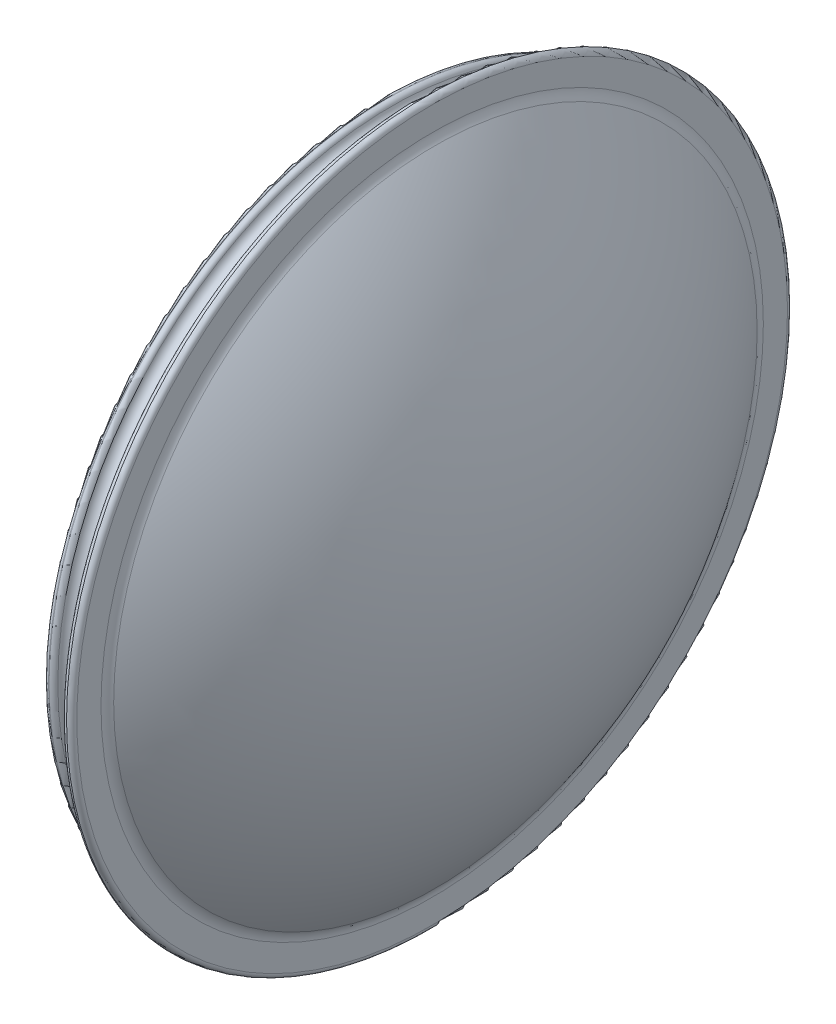
ISO-10303-21;
HEADER;
FILE_DESCRIPTION(('STEP AP214'),'2;1');
FILE_NAME('part.step','',(''),(''),'','','');
FILE_SCHEMA(('AUTOMOTIVE_DESIGN { 1 0 10303 214 1 1 1 1 }'));
ENDSEC;
DATA;
#1=APPLICATION_CONTEXT('core data for automotive mechanical design processes');
#2=APPLICATION_PROTOCOL_DEFINITION('international standard','automotive_design',2000,#1);
#3=PRODUCT_CONTEXT('',#1,'mechanical');
#4=PRODUCT('Part','Part','',(#3));
#5=PRODUCT_RELATED_PRODUCT_CATEGORY('part','',(#4));
#6=PRODUCT_DEFINITION_FORMATION('','',#4);
#7=PRODUCT_DEFINITION_CONTEXT('part definition',#1,'design');
#8=PRODUCT_DEFINITION('design','',#6,#7);
#9=PRODUCT_DEFINITION_SHAPE('','',#8);
#10=(LENGTH_UNIT() NAMED_UNIT(*) SI_UNIT(.MILLI.,.METRE.));
#11=(NAMED_UNIT(*) PLANE_ANGLE_UNIT() SI_UNIT($,.RADIAN.));
#12=(NAMED_UNIT(*) SI_UNIT($,.STERADIAN.) SOLID_ANGLE_UNIT());
#13=UNCERTAINTY_MEASURE_WITH_UNIT(LENGTH_MEASURE(1.E-05),#10,'distance_accuracy_value','');
#14=(GEOMETRIC_REPRESENTATION_CONTEXT(3) GLOBAL_UNCERTAINTY_ASSIGNED_CONTEXT((#13)) GLOBAL_UNIT_ASSIGNED_CONTEXT((#10,
#11,#12)) REPRESENTATION_CONTEXT('',''));
#15=CARTESIAN_POINT('',(0.,0.,0.));
#16=DIRECTION('',(0.,0.,1.));
#17=DIRECTION('',(1.,0.,0.));
#18=AXIS2_PLACEMENT_3D('',#15,#16,#17);
#19=CARTESIAN_POINT('',(350.,0.,0.));
#20=DIRECTION('',(1.,0.,0.));
#21=DIRECTION('',(0.,0.,-1.));
#22=AXIS2_PLACEMENT_3D('',#19,#20,#21);
#23=CYLINDRICAL_SURFACE('',#22,316.385840391127);
#24=CARTESIAN_POINT('',(370.,0.,0.));
#25=DIRECTION('',(-1.,0.,0.));
#26=DIRECTION('',(0.,0.,1.));
#27=AXIS2_PLACEMENT_3D('',#24,#25,#26);
#28=CIRCLE('',#27,316.385840391127);
#29=CARTESIAN_POINT('',(370.,0.,316.385840391127));
#30=VERTEX_POINT('',#29);
#31=EDGE_CURVE('E87',#30,#30,#28,.F.);
#32=ORIENTED_EDGE('',*,*,#31,.T.);
#33=EDGE_LOOP('',(#32));
#34=FACE_BOUND('',#33,.T.);
#35=CARTESIAN_POINT('',(380.,0.,0.));
#36=DIRECTION('',(1.,0.,0.));
#37=DIRECTION('',(0.,0.,-1.));
#38=AXIS2_PLACEMENT_3D('',#35,#36,#37);
#39=CIRCLE('',#38,316.385840391127);
#40=CARTESIAN_POINT('',(380.,0.,-316.385840391127));
#41=VERTEX_POINT('',#40);
#42=EDGE_CURVE('E91',#41,#41,#39,.F.);
#43=ORIENTED_EDGE('',*,*,#42,.T.);
#44=EDGE_LOOP('',(#43));
#45=FACE_BOUND('',#44,.T.);
#46=ADVANCED_FACE('F38',(#34,#45),#23,.T.);
#47=CARTESIAN_POINT('',(390.,0.,0.));
#48=DIRECTION('',(1.,0.,0.));
#49=DIRECTION('',(0.,0.,-1.));
#50=AXIS2_PLACEMENT_3D('',#47,#48,#49);
#51=PLANE('',#50);
#52=CARTESIAN_POINT('',(390.,0.,0.));
#53=DIRECTION('',(1.,0.,0.));
#54=DIRECTION('',(0.,0.,-1.));
#55=AXIS2_PLACEMENT_3D('',#52,#53,#54);
#56=CIRCLE('',#55,345.);
#57=CARTESIAN_POINT('',(390.,0.,-345.));
#58=VERTEX_POINT('',#57);
#59=EDGE_CURVE('E67',#58,#58,#56,.F.);
#60=ORIENTED_EDGE('',*,*,#59,.T.);
#61=EDGE_LOOP('',(#60));
#62=FACE_BOUND('',#61,.T.);
#63=CARTESIAN_POINT('',(390.,0.,0.));
#64=DIRECTION('',(1.,0.,0.));
#65=DIRECTION('',(0.,0.,-1.));
#66=AXIS2_PLACEMENT_3D('',#63,#64,#65);
#67=CIRCLE('',#66,326.385840391127);
#68=CARTESIAN_POINT('',(390.,0.,-326.385840391127));
#69=VERTEX_POINT('',#68);
#70=EDGE_CURVE('E83',#69,#69,#67,.T.);
#71=ORIENTED_EDGE('',*,*,#70,.T.);
#72=EDGE_LOOP('',(#71));
#73=FACE_BOUND('',#72,.T.);
#74=ADVANCED_FACE('F134',(#62,#73),#51,.F.);
#75=CARTESIAN_POINT('',(400.,0.,0.));
#76=DIRECTION('',(1.,0.,0.));
#77=DIRECTION('',(0.,0.,-1.));
#78=AXIS2_PLACEMENT_3D('',#75,#76,#77);
#79=PLANE('',#78);
#80=CARTESIAN_POINT('',(400.,0.,0.));
#81=DIRECTION('',(1.,0.,0.));
#82=DIRECTION('',(0.,0.,-1.));
#83=AXIS2_PLACEMENT_3D('',#80,#81,#82);
#84=CIRCLE('',#83,321.558703816271);
#85=CARTESIAN_POINT('',(400.,0.,-321.558703816271));
#86=VERTEX_POINT('',#85);
#87=EDGE_CURVE('E46',#86,#86,#84,.F.);
#88=ORIENTED_EDGE('',*,*,#87,.T.);
#89=EDGE_LOOP('',(#88));
#90=FACE_BOUND('',#89,.T.);
#91=CARTESIAN_POINT('',(400.,0.,0.));
#92=DIRECTION('',(1.,0.,0.));
#93=DIRECTION('',(0.,0.,-1.));
#94=AXIS2_PLACEMENT_3D('',#91,#92,#93);
#95=CIRCLE('',#94,345.);
#96=CARTESIAN_POINT('',(400.,0.,-345.));
#97=VERTEX_POINT('',#96);
#98=EDGE_CURVE('E51',#97,#97,#95,.T.);
#99=ORIENTED_EDGE('',*,*,#98,.T.);
#100=EDGE_LOOP('',(#99));
#101=FACE_BOUND('',#100,.T.);
#102=ADVANCED_FACE('F141',(#90,#101),#79,.T.);
#103=CARTESIAN_POINT('',(0.,0.,0.));
#104=DIRECTION('',(0.,1.,0.));
#105=DIRECTION('',(1.,0.,0.));
#106=AXIS2_PLACEMENT_3D('',#103,#104,#105);
#107=SPHERICAL_SURFACE('',#106,510.);
#108=CARTESIAN_POINT('',(0.,0.,0.));
#109=DIRECTION('',(-1.,0.,0.));
#110=DIRECTION('',(0.,0.,1.));
#111=AXIS2_PLACEMENT_3D('',#108,#109,#110);
#112=SPHERICAL_SURFACE('',#111,510.);
#113=CARTESIAN_POINT('',(403.142857142857,0.,0.));
#114=DIRECTION('',(-1.,0.,0.));
#115=DIRECTION('',(0.,0.,1.));
#116=AXIS2_PLACEMENT_3D('',#113,#114,#115);
#117=CIRCLE('',#116,312.371312278663);
#118=CARTESIAN_POINT('',(403.142857142857,0.,312.371312278663));
#119=VERTEX_POINT('',#118);
#120=EDGE_CURVE('E10',#119,#119,#117,.F.);
#121=ORIENTED_EDGE('',*,*,#120,.T.);
#122=EDGE_LOOP('',(#121));
#123=FACE_BOUND('',#122,.T.);
#124=ADVANCED_FACE('F148',(#123),#112,.T.);
#125=CARTESIAN_POINT('',(360.,0.,0.));
#126=DIRECTION('',(-1.,0.,0.));
#127=DIRECTION('',(0.,0.,1.));
#128=AXIS2_PLACEMENT_3D('',#125,#126,#127);
#129=CYLINDRICAL_SURFACE('',#128,327.5);
#130=CARTESIAN_POINT('',(355.,0.,0.));
#131=DIRECTION('',(-1.,0.,0.));
#132=DIRECTION('',(0.,0.,1.));
#133=AXIS2_PLACEMENT_3D('',#130,#131,#132);
#134=CIRCLE('',#133,327.5);
#135=CARTESIAN_POINT('',(355.,0.,327.5));
#136=VERTEX_POINT('',#135);
#137=EDGE_CURVE('E71',#136,#136,#134,.F.);
#138=ORIENTED_EDGE('',*,*,#137,.T.);
#139=EDGE_LOOP('',(#138));
#140=FACE_BOUND('',#139,.T.);
#141=CARTESIAN_POINT('',(355.512065555964,0.,0.));
#142=DIRECTION('',(1.,0.,0.));
#143=DIRECTION('',(0.,0.,-1.));
#144=AXIS2_PLACEMENT_3D('',#141,#142,#143);
#145=CIRCLE('',#144,327.5);
#146=CARTESIAN_POINT('',(355.512065555964,0.,-327.5));
#147=VERTEX_POINT('',#146);
#148=EDGE_CURVE('E75',#147,#147,#145,.F.);
#149=ORIENTED_EDGE('',*,*,#148,.T.);
#150=EDGE_LOOP('',(#149));
#151=FACE_BOUND('',#150,.T.);
#152=ADVANCED_FACE('F127',(#140,#151),#129,.T.);
#153=CARTESIAN_POINT('',(0.,0.,0.));
#154=DIRECTION('',(0.,1.,0.));
#155=DIRECTION('',(1.,0.,0.));
#156=AXIS2_PLACEMENT_3D('',#153,#154,#155);
#157=SPHERICAL_SURFACE('',#156,500.);
#158=CARTESIAN_POINT('',(0.,0.,0.));
#159=DIRECTION('',(-1.,0.,0.));
#160=DIRECTION('',(0.,0.,1.));
#161=AXIS2_PLACEMENT_3D('',#158,#159,#160);
#162=SPHERICAL_SURFACE('',#161,500.);
#163=CARTESIAN_POINT('',(403.028931798602,0.,0.));
#164=DIRECTION('',(-1.,0.,0.));
#165=DIRECTION('',(0.,0.,1.));
#166=AXIS2_PLACEMENT_3D('',#163,#164,#165);
#167=CIRCLE('',#166,295.918367346939);
#168=CARTESIAN_POINT('',(403.028931798602,0.,295.918367346939));
#169=VERTEX_POINT('',#168);
#170=EDGE_CURVE('E95',#169,#169,#167,.T.);
#171=ORIENTED_EDGE('',*,*,#170,.T.);
#172=EDGE_LOOP('',(#171));
#173=FACE_BOUND('',#172,.T.);
#174=ADVANCED_FACE('F115',(#173),#162,.F.);
#175=CARTESIAN_POINT('',(394.96835316263,0.,0.));
#176=DIRECTION('',(-1.,0.,0.));
#177=DIRECTION('',(0.,0.,1.));
#178=AXIS2_PLACEMENT_3D('',#175,#176,#177);
#179=TOROIDAL_SURFACE('',#178,290.,10.);
#180=ORIENTED_EDGE('',*,*,#170,.F.);
#181=EDGE_LOOP('',(#180));
#182=FACE_BOUND('',#181,.T.);
#183=CARTESIAN_POINT('',(394.96835316263,0.,0.));
#184=DIRECTION('',(-1.,0.,0.));
#185=DIRECTION('',(0.,0.,1.));
#186=AXIS2_PLACEMENT_3D('',#183,#184,#185);
#187=CIRCLE('',#186,300.);
#188=CARTESIAN_POINT('',(394.96835316263,0.,300.));
#189=VERTEX_POINT('',#188);
#190=EDGE_CURVE('E62',#189,#189,#187,.F.);
#191=ORIENTED_EDGE('',*,*,#190,.F.);
#192=EDGE_LOOP('',(#191));
#193=FACE_BOUND('',#192,.T.);
#194=ADVANCED_FACE('F113',(#182,#193),#179,.F.);
#195=CARTESIAN_POINT('',(350.,0.,0.));
#196=DIRECTION('',(1.,0.,0.));
#197=DIRECTION('',(0.,0.,-1.));
#198=AXIS2_PLACEMENT_3D('',#195,#196,#197);
#199=CYLINDRICAL_SURFACE('',#198,300.);
#200=CARTESIAN_POINT('',(360.,0.,0.));
#201=DIRECTION('',(-1.,0.,0.));
#202=DIRECTION('',(0.,0.,1.));
#203=AXIS2_PLACEMENT_3D('',#200,#201,#202);
#204=CIRCLE('',#203,300.);
#205=CARTESIAN_POINT('',(360.,0.,300.));
#206=VERTEX_POINT('',#205);
#207=EDGE_CURVE('E103',#206,#206,#204,.T.);
#208=ORIENTED_EDGE('',*,*,#207,.T.);
#209=EDGE_LOOP('',(#208));
#210=FACE_BOUND('',#209,.T.);
#211=ORIENTED_EDGE('',*,*,#190,.T.);
#212=EDGE_LOOP('',(#211));
#213=FACE_BOUND('',#212,.T.);
#214=ADVANCED_FACE('F111',(#210,#213),#199,.F.);
#215=CARTESIAN_POINT('',(360.,0.,0.));
#216=DIRECTION('',(-1.,0.,0.));
#217=DIRECTION('',(0.,0.,1.));
#218=AXIS2_PLACEMENT_3D('',#215,#216,#217);
#219=TOROIDAL_SURFACE('',#218,310.,10.);
#220=CARTESIAN_POINT('',(350.,0.,0.));
#221=DIRECTION('',(-1.,0.,0.));
#222=DIRECTION('',(0.,0.,1.));
#223=AXIS2_PLACEMENT_3D('',#220,#221,#222);
#224=CIRCLE('',#223,310.);
#225=CARTESIAN_POINT('',(350.,0.,310.));
#226=VERTEX_POINT('',#225);
#227=EDGE_CURVE('E99',#226,#226,#224,.F.);
#228=ORIENTED_EDGE('',*,*,#227,.F.);
#229=EDGE_LOOP('',(#228));
#230=FACE_BOUND('',#229,.T.);
#231=ORIENTED_EDGE('',*,*,#207,.F.);
#232=EDGE_LOOP('',(#231));
#233=FACE_BOUND('',#232,.T.);
#234=ADVANCED_FACE('F123',(#230,#233),#219,.T.);
#235=CARTESIAN_POINT('',(350.,0.,0.));
#236=DIRECTION('',(-1.,0.,0.));
#237=DIRECTION('',(0.,0.,1.));
#238=AXIS2_PLACEMENT_3D('',#235,#236,#237);
#239=PLANE('',#238);
#240=CARTESIAN_POINT('',(350.,0.,0.));
#241=DIRECTION('',(-1.,0.,0.));
#242=DIRECTION('',(0.,0.,1.));
#243=AXIS2_PLACEMENT_3D('',#240,#241,#242);
#244=CIRCLE('',#243,322.5);
#245=CARTESIAN_POINT('',(350.,0.,322.5));
#246=VERTEX_POINT('',#245);
#247=EDGE_CURVE('E79',#246,#246,#244,.T.);
#248=ORIENTED_EDGE('',*,*,#247,.T.);
#249=EDGE_LOOP('',(#248));
#250=FACE_BOUND('',#249,.T.);
#251=ORIENTED_EDGE('',*,*,#227,.T.);
#252=EDGE_LOOP('',(#251));
#253=FACE_BOUND('',#252,.T.);
#254=ADVANCED_FACE('F147',(#250,#253),#239,.T.);
#255=CARTESIAN_POINT('',(370.,0.,0.));
#256=DIRECTION('',(-1.,0.,0.));
#257=DIRECTION('',(0.,0.,1.));
#258=AXIS2_PLACEMENT_3D('',#255,#256,#257);
#259=TOROIDAL_SURFACE('',#258,326.385840391127,10.);
#260=CARTESIAN_POINT('',(360.341377037315,0.,0.));
#261=DIRECTION('',(1.,0.,0.));
#262=DIRECTION('',(0.,0.,-1.));
#263=AXIS2_PLACEMENT_3D('',#260,#261,#262);
#264=CIRCLE('',#263,323.795280130377);
#265=CARTESIAN_POINT('',(360.341377037315,0.,-323.795280130377));
#266=VERTEX_POINT('',#265);
#267=EDGE_CURVE('E56',#266,#266,#264,.T.);
#268=ORIENTED_EDGE('',*,*,#267,.T.);
#269=EDGE_LOOP('',(#268));
#270=FACE_BOUND('',#269,.T.);
#271=ORIENTED_EDGE('',*,*,#31,.F.);
#272=EDGE_LOOP('',(#271));
#273=FACE_BOUND('',#272,.T.);
#274=ADVANCED_FACE('F155',(#270,#273),#259,.F.);
#275=CARTESIAN_POINT('',(380.,0.,0.));
#276=DIRECTION('',(1.,0.,0.));
#277=DIRECTION('',(0.,0.,-1.));
#278=AXIS2_PLACEMENT_3D('',#275,#276,#277);
#279=TOROIDAL_SURFACE('',#278,326.385840391127,10.);
#280=ORIENTED_EDGE('',*,*,#42,.F.);
#281=EDGE_LOOP('',(#280));
#282=FACE_BOUND('',#281,.T.);
#283=ORIENTED_EDGE('',*,*,#70,.F.);
#284=EDGE_LOOP('',(#283));
#285=FACE_BOUND('',#284,.T.);
#286=ADVANCED_FACE('F165',(#282,#285),#279,.F.);
#287=CARTESIAN_POINT('',(355.,0.,0.));
#288=DIRECTION('',(-1.,0.,0.));
#289=DIRECTION('',(0.,0.,1.));
#290=AXIS2_PLACEMENT_3D('',#287,#288,#289);
#291=TOROIDAL_SURFACE('',#290,322.5,5.);
#292=ORIENTED_EDGE('',*,*,#137,.F.);
#293=EDGE_LOOP('',(#292));
#294=FACE_BOUND('',#293,.T.);
#295=ORIENTED_EDGE('',*,*,#247,.F.);
#296=EDGE_LOOP('',(#295));
#297=FACE_BOUND('',#296,.T.);
#298=ADVANCED_FACE('F169',(#294,#297),#291,.T.);
#299=CARTESIAN_POINT('',(395.,0.,0.));
#300=DIRECTION('',(1.,0.,0.));
#301=DIRECTION('',(0.,0.,-1.));
#302=AXIS2_PLACEMENT_3D('',#299,#300,#301);
#303=TOROIDAL_SURFACE('',#302,345.,5.);
#304=ORIENTED_EDGE('',*,*,#98,.F.);
#305=EDGE_LOOP('',(#304));
#306=FACE_BOUND('',#305,.T.);
#307=CARTESIAN_POINT('',(395.,0.,0.));
#308=DIRECTION('',(1.,0.,0.));
#309=DIRECTION('',(0.,0.,-1.));
#310=AXIS2_PLACEMENT_3D('',#307,#308,#309);
#311=CIRCLE('',#310,350.);
#312=CARTESIAN_POINT('',(395.,0.,-350.));
#313=VERTEX_POINT('',#312);
#314=EDGE_CURVE('E59',#313,#313,#311,.F.);
#315=ORIENTED_EDGE('',*,*,#314,.F.);
#316=EDGE_LOOP('',(#315));
#317=FACE_BOUND('',#316,.T.);
#318=ADVANCED_FACE('F171',(#306,#317),#303,.T.);
#319=CARTESIAN_POINT('',(395.,0.,0.));
#320=DIRECTION('',(1.,0.,0.));
#321=DIRECTION('',(0.,0.,-1.));
#322=AXIS2_PLACEMENT_3D('',#319,#320,#321);
#323=TOROIDAL_SURFACE('',#322,345.,5.);
#324=ORIENTED_EDGE('',*,*,#59,.F.);
#325=EDGE_LOOP('',(#324));
#326=FACE_BOUND('',#325,.T.);
#327=ORIENTED_EDGE('',*,*,#314,.T.);
#328=EDGE_LOOP('',(#327));
#329=FACE_BOUND('',#328,.T.);
#330=ADVANCED_FACE('F178',(#326,#329),#323,.T.);
#331=CARTESIAN_POINT('',(355.512065555964,0.,0.));
#332=DIRECTION('',(1.,0.,0.));
#333=DIRECTION('',(0.,0.,-1.));
#334=AXIS2_PLACEMENT_3D('',#331,#332,#333);
#335=TOROIDAL_SURFACE('',#334,322.5,5.);
#336=ORIENTED_EDGE('',*,*,#267,.F.);
#337=EDGE_LOOP('',(#336));
#338=FACE_BOUND('',#337,.T.);
#339=ORIENTED_EDGE('',*,*,#148,.F.);
#340=EDGE_LOOP('',(#339));
#341=FACE_BOUND('',#340,.T.);
#342=ADVANCED_FACE('F186',(#338,#341),#335,.T.);
#343=CARTESIAN_POINT('',(415.,0.,0.));
#344=DIRECTION('',(1.,0.,0.));
#345=DIRECTION('',(0.,0.,-1.));
#346=AXIS2_PLACEMENT_3D('',#343,#344,#345);
#347=TOROIDAL_SURFACE('',#346,321.558703816271,15.);
#348=ORIENTED_EDGE('',*,*,#120,.F.);
#349=EDGE_LOOP('',(#348));
#350=FACE_BOUND('',#349,.T.);
#351=ORIENTED_EDGE('',*,*,#87,.F.);
#352=EDGE_LOOP('',(#351));
#353=FACE_BOUND('',#352,.T.);
#354=ADVANCED_FACE('F40',(#350,#353),#347,.F.);
#355=CLOSED_SHELL('',(#46,#74,#102,#124,#152,#174,#194,#214,#234,#254,#274,#286,#298,#318,#330,
#342,#354));
#356=MANIFOLD_SOLID_BREP('B2',#355);
#357=ADVANCED_BREP_SHAPE_REPRESENTATION('',(#18,#356),#14);
#358=SHAPE_DEFINITION_REPRESENTATION(#9,#357);
ENDSEC;
END-ISO-10303-21;
